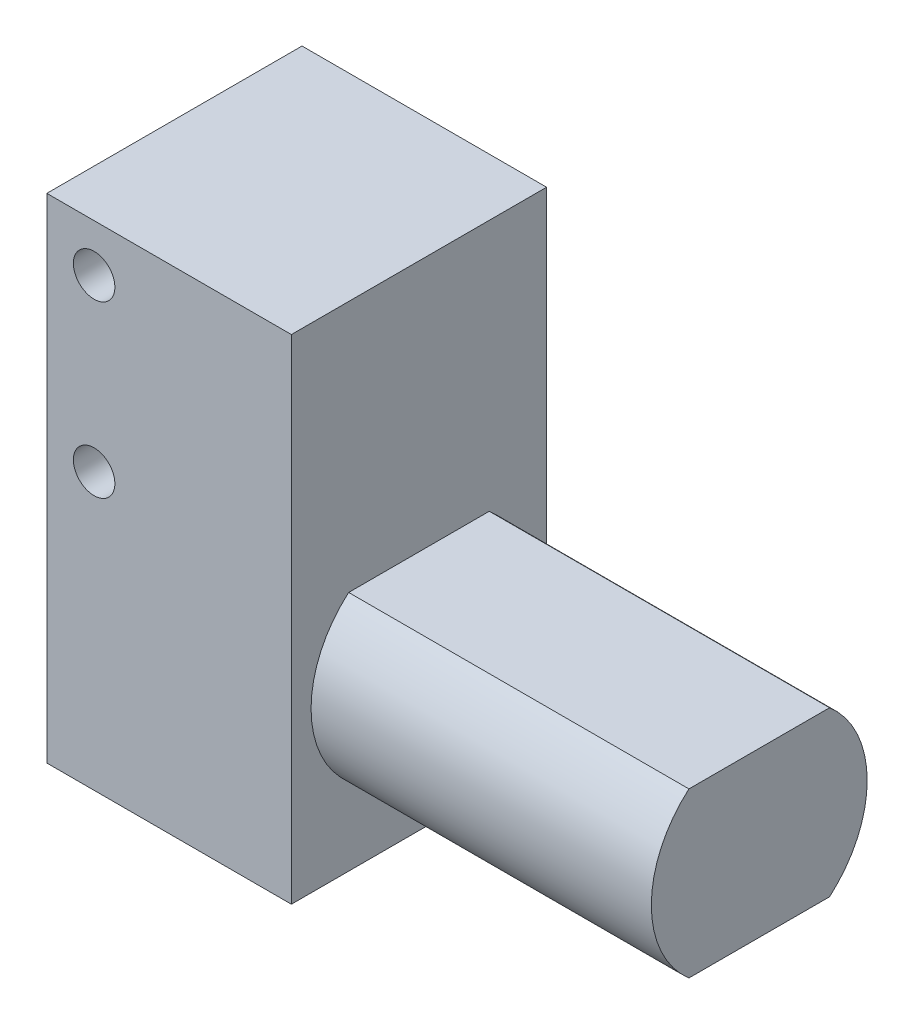
ISO-10303-21;
HEADER;
FILE_DESCRIPTION(('STEP AP214'),'2;1');
FILE_NAME('part.step','',(''),(''),'','','');
FILE_SCHEMA(('AUTOMOTIVE_DESIGN { 1 0 10303 214 1 1 1 1 }'));
ENDSEC;
DATA;
#1=APPLICATION_CONTEXT('core data for automotive mechanical design processes');
#2=APPLICATION_PROTOCOL_DEFINITION('international standard','automotive_design',2000,#1);
#3=PRODUCT_CONTEXT('',#1,'mechanical');
#4=PRODUCT('Part','Part','',(#3));
#5=PRODUCT_RELATED_PRODUCT_CATEGORY('part','',(#4));
#6=PRODUCT_DEFINITION_FORMATION('','',#4);
#7=PRODUCT_DEFINITION_CONTEXT('part definition',#1,'design');
#8=PRODUCT_DEFINITION('design','',#6,#7);
#9=PRODUCT_DEFINITION_SHAPE('','',#8);
#10=(LENGTH_UNIT() NAMED_UNIT(*) SI_UNIT(.MILLI.,.METRE.));
#11=(NAMED_UNIT(*) PLANE_ANGLE_UNIT() SI_UNIT($,.RADIAN.));
#12=(NAMED_UNIT(*) SI_UNIT($,.STERADIAN.) SOLID_ANGLE_UNIT());
#13=UNCERTAINTY_MEASURE_WITH_UNIT(LENGTH_MEASURE(1.E-05),#10,'distance_accuracy_value','');
#14=(GEOMETRIC_REPRESENTATION_CONTEXT(3) GLOBAL_UNCERTAINTY_ASSIGNED_CONTEXT((#13)) GLOBAL_UNIT_ASSIGNED_CONTEXT((#10,
#11,#12)) REPRESENTATION_CONTEXT('',''));
#15=CARTESIAN_POINT('',(0.,0.,0.));
#16=DIRECTION('',(0.,0.,1.));
#17=DIRECTION('',(1.,0.,0.));
#18=AXIS2_PLACEMENT_3D('',#15,#16,#17);
#19=CARTESIAN_POINT('',(55.,15.,0.));
#20=DIRECTION('',(-1.,0.,0.));
#21=DIRECTION('',(0.,0.,1.));
#22=AXIS2_PLACEMENT_3D('',#19,#20,#21);
#23=CYLINDRICAL_SURFACE('',#22,10.15);
#24=CARTESIAN_POINT('',(23.,15.,0.));
#25=DIRECTION('',(-1.,0.,0.));
#26=DIRECTION('',(0.,0.,1.));
#27=AXIS2_PLACEMENT_3D('',#24,#25,#26);
#28=CIRCLE('',#27,10.15);
#29=CARTESIAN_POINT('',(23.,7.3,-6.61305526969192));
#30=VERTEX_POINT('',#29);
#31=CARTESIAN_POINT('',(23.,22.7,-6.61305526969192));
#32=VERTEX_POINT('',#31);
#33=EDGE_CURVE('E303',#30,#32,#28,.F.);
#34=ORIENTED_EDGE('',*,*,#33,.T.);
#35=DIRECTION('',(-1.,0.,0.));
#36=VECTOR('',#35,1.);
#37=CARTESIAN_POINT('',(55.,22.7,-6.61305526969192));
#38=LINE('',#37,#36);
#39=CARTESIAN_POINT('',(55.,22.7,-6.61305526969192));
#40=VERTEX_POINT('',#39);
#41=EDGE_CURVE('E192',#32,#40,#38,.F.);
#42=ORIENTED_EDGE('',*,*,#41,.T.);
#43=CARTESIAN_POINT('',(55.,15.,0.));
#44=DIRECTION('',(1.,0.,0.));
#45=DIRECTION('',(0.,0.,-1.));
#46=AXIS2_PLACEMENT_3D('',#43,#44,#45);
#47=CIRCLE('',#46,10.15);
#48=CARTESIAN_POINT('',(55.,7.3,-6.61305526969192));
#49=VERTEX_POINT('',#48);
#50=EDGE_CURVE('E198',#49,#40,#47,.T.);
#51=ORIENTED_EDGE('',*,*,#50,.F.);
#52=DIRECTION('',(-1.,0.,0.));
#53=VECTOR('',#52,1.);
#54=CARTESIAN_POINT('',(55.,7.3,-6.61305526969192));
#55=LINE('',#54,#53);
#56=EDGE_CURVE('E56',#49,#30,#55,.T.);
#57=ORIENTED_EDGE('',*,*,#56,.T.);
#58=EDGE_LOOP('',(#34,#42,#51,#57));
#59=FACE_BOUND('',#58,.T.);
#60=ADVANCED_FACE('F33',(#59),#23,.T.);
#61=CARTESIAN_POINT('',(-9.,34.2,0.));
#62=DIRECTION('',(1.,0.,0.));
#63=DIRECTION('',(0.,0.,-1.));
#64=AXIS2_PLACEMENT_3D('',#61,#62,#63);
#65=CYLINDRICAL_SURFACE('',#64,2.7);
#66=CARTESIAN_POINT('',(0.,34.2,0.));
#67=DIRECTION('',(1.,0.,0.));
#68=DIRECTION('',(0.,0.,-1.));
#69=AXIS2_PLACEMENT_3D('',#66,#67,#68);
#70=CIRCLE('',#69,2.7);
#71=CARTESIAN_POINT('',(0.,34.2,-2.7));
#72=VERTEX_POINT('',#71);
#73=EDGE_CURVE('E288',#72,#72,#70,.F.);
#74=ORIENTED_EDGE('',*,*,#73,.T.);
#75=EDGE_LOOP('',(#74));
#76=FACE_BOUND('',#75,.T.);
#77=DIRECTION('',(1.,0.,0.));
#78=VECTOR('',#77,1.);
#79=CARTESIAN_POINT('',(-9.,36.2560885194952,-1.75));
#80=LINE('',#79,#78);
#81=CARTESIAN_POINT('',(-9.,36.2560885194952,-1.75));
#82=VERTEX_POINT('',#81);
#83=CARTESIAN_POINT('',(-2.,36.2560885194952,-1.75));
#84=VERTEX_POINT('',#83);
#85=EDGE_CURVE('E227',#82,#84,#80,.T.);
#86=ORIENTED_EDGE('',*,*,#85,.F.);
#87=CARTESIAN_POINT('',(-9.,34.2,0.));
#88=DIRECTION('',(-1.,0.,0.));
#89=DIRECTION('',(0.,0.,1.));
#90=AXIS2_PLACEMENT_3D('',#87,#88,#89);
#91=CIRCLE('',#90,2.7);
#92=CARTESIAN_POINT('',(-9.,36.2560885194952,1.75));
#93=VERTEX_POINT('',#92);
#94=EDGE_CURVE('E233',#93,#82,#91,.T.);
#95=ORIENTED_EDGE('',*,*,#94,.F.);
#96=DIRECTION('',(1.,0.,0.));
#97=VECTOR('',#96,1.);
#98=CARTESIAN_POINT('',(-9.,36.2560885194952,1.75));
#99=LINE('',#98,#97);
#100=CARTESIAN_POINT('',(-2.,36.2560885194952,1.75));
#101=VERTEX_POINT('',#100);
#102=EDGE_CURVE('E218',#101,#93,#99,.F.);
#103=ORIENTED_EDGE('',*,*,#102,.F.);
#104=CARTESIAN_POINT('',(-2.,34.2,0.));
#105=DIRECTION('',(-1.,0.,0.));
#106=DIRECTION('',(0.,0.,1.));
#107=AXIS2_PLACEMENT_3D('',#104,#105,#106);
#108=CIRCLE('',#107,2.7);
#109=CARTESIAN_POINT('',(-2.,32.1439114805048,1.75));
#110=VERTEX_POINT('',#109);
#111=EDGE_CURVE('E297',#110,#101,#108,.T.);
#112=ORIENTED_EDGE('',*,*,#111,.F.);
#113=DIRECTION('',(1.,0.,0.));
#114=VECTOR('',#113,1.);
#115=CARTESIAN_POINT('',(-9.,32.1439114805048,1.75));
#116=LINE('',#115,#114);
#117=CARTESIAN_POINT('',(-9.,32.1439114805048,1.75));
#118=VERTEX_POINT('',#117);
#119=EDGE_CURVE('E222',#118,#110,#116,.T.);
#120=ORIENTED_EDGE('',*,*,#119,.F.);
#121=CARTESIAN_POINT('',(-9.,32.1439114805048,-1.75));
#122=VERTEX_POINT('',#121);
#123=EDGE_CURVE('E230',#122,#118,#91,.T.);
#124=ORIENTED_EDGE('',*,*,#123,.F.);
#125=DIRECTION('',(1.,0.,0.));
#126=VECTOR('',#125,1.);
#127=CARTESIAN_POINT('',(-9.,32.1439114805048,-1.75));
#128=LINE('',#127,#126);
#129=CARTESIAN_POINT('',(-2.,32.1439114805048,-1.75));
#130=VERTEX_POINT('',#129);
#131=EDGE_CURVE('E225',#130,#122,#128,.F.);
#132=ORIENTED_EDGE('',*,*,#131,.F.);
#133=CARTESIAN_POINT('',(-2.,34.2,0.));
#134=DIRECTION('',(-1.,0.,0.));
#135=DIRECTION('',(0.,0.,1.));
#136=AXIS2_PLACEMENT_3D('',#133,#134,#135);
#137=CIRCLE('',#136,2.7);
#138=EDGE_CURVE('E299',#84,#130,#137,.T.);
#139=ORIENTED_EDGE('',*,*,#138,.F.);
#140=EDGE_LOOP('',(#86,#95,#103,#112,#120,#124,#132,#139));
#141=FACE_BOUND('',#140,.T.);
#142=ADVANCED_FACE('F333',(#76,#141),#65,.T.);
#143=CARTESIAN_POINT('',(-9.,34.2,0.));
#144=DIRECTION('',(-1.,0.,0.));
#145=DIRECTION('',(0.,0.,1.));
#146=AXIS2_PLACEMENT_3D('',#143,#144,#145);
#147=PLANE('',#146);
#148=ORIENTED_EDGE('',*,*,#94,.T.);
#149=DIRECTION('',(0.,-1.,0.));
#150=VECTOR('',#149,1.);
#151=CARTESIAN_POINT('',(-9.,34.2,-1.75));
#152=LINE('',#151,#150);
#153=EDGE_CURVE('E294',#82,#122,#152,.T.);
#154=ORIENTED_EDGE('',*,*,#153,.T.);
#155=ORIENTED_EDGE('',*,*,#123,.T.);
#156=DIRECTION('',(0.,1.,0.));
#157=VECTOR('',#156,1.);
#158=CARTESIAN_POINT('',(-9.,34.2,1.75));
#159=LINE('',#158,#157);
#160=EDGE_CURVE('E291',#118,#93,#159,.T.);
#161=ORIENTED_EDGE('',*,*,#160,.T.);
#162=EDGE_LOOP('',(#148,#154,#155,#161));
#163=FACE_BOUND('',#162,.T.);
#164=ADVANCED_FACE('F337',(#163),#147,.T.);
#165=CARTESIAN_POINT('',(0.,0.,12.));
#166=DIRECTION('',(1.,0.,0.));
#167=DIRECTION('',(0.,0.,-1.));
#168=AXIS2_PLACEMENT_3D('',#165,#166,#167);
#169=PLANE('',#168);
#170=CARTESIAN_POINT('',(0.,10.45,-8.));
#171=DIRECTION('',(-1.,0.,0.));
#172=DIRECTION('',(0.,0.,1.));
#173=AXIS2_PLACEMENT_3D('',#170,#171,#172);
#174=CIRCLE('',#173,1.95);
#175=CARTESIAN_POINT('',(0.,10.45,-6.05));
#176=VERTEX_POINT('',#175);
#177=EDGE_CURVE('E206',#176,#176,#174,.T.);
#178=ORIENTED_EDGE('',*,*,#177,.F.);
#179=EDGE_LOOP('',(#178));
#180=FACE_BOUND('',#179,.T.);
#181=CARTESIAN_POINT('',(0.,10.45,8.));
#182=DIRECTION('',(-1.,0.,0.));
#183=DIRECTION('',(0.,0.,-1.));
#184=AXIS2_PLACEMENT_3D('',#181,#182,#183);
#185=CIRCLE('',#184,1.95);
#186=CARTESIAN_POINT('',(0.,10.45,6.05));
#187=VERTEX_POINT('',#186);
#188=EDGE_CURVE('E212',#187,#187,#185,.T.);
#189=ORIENTED_EDGE('',*,*,#188,.F.);
#190=EDGE_LOOP('',(#189));
#191=FACE_BOUND('',#190,.T.);
#192=ORIENTED_EDGE('',*,*,#73,.F.);
#193=EDGE_LOOP('',(#192));
#194=FACE_BOUND('',#193,.T.);
#195=DIRECTION('',(0.,-1.,0.));
#196=VECTOR('',#195,1.);
#197=CARTESIAN_POINT('',(0.,0.,-12.));
#198=LINE('',#197,#196);
#199=CARTESIAN_POINT('',(0.,46.4,-12.));
#200=VERTEX_POINT('',#199);
#201=CARTESIAN_POINT('',(0.,0.,-12.));
#202=VERTEX_POINT('',#201);
#203=EDGE_CURVE('E250',#200,#202,#198,.T.);
#204=ORIENTED_EDGE('',*,*,#203,.T.);
#205=DIRECTION('',(0.,0.,-1.));
#206=VECTOR('',#205,1.);
#207=CARTESIAN_POINT('',(0.,0.,12.));
#208=LINE('',#207,#206);
#209=CARTESIAN_POINT('',(0.,0.,12.));
#210=VERTEX_POINT('',#209);
#211=EDGE_CURVE('E285',#210,#202,#208,.T.);
#212=ORIENTED_EDGE('',*,*,#211,.F.);
#213=DIRECTION('',(0.,-1.,0.));
#214=VECTOR('',#213,1.);
#215=CARTESIAN_POINT('',(0.,0.,12.));
#216=LINE('',#215,#214);
#217=CARTESIAN_POINT('',(0.,46.4,12.));
#218=VERTEX_POINT('',#217);
#219=EDGE_CURVE('E259',#218,#210,#216,.T.);
#220=ORIENTED_EDGE('',*,*,#219,.F.);
#221=DIRECTION('',(0.,0.,-1.));
#222=VECTOR('',#221,1.);
#223=CARTESIAN_POINT('',(0.,46.4,12.));
#224=LINE('',#223,#222);
#225=EDGE_CURVE('E269',#218,#200,#224,.T.);
#226=ORIENTED_EDGE('',*,*,#225,.T.);
#227=EDGE_LOOP('',(#204,#212,#220,#226));
#228=FACE_BOUND('',#227,.T.);
#229=ADVANCED_FACE('F35',(#180,#191,#194,#228),#169,.F.);
#230=CARTESIAN_POINT('',(0.,0.,12.));
#231=DIRECTION('',(0.,1.,0.));
#232=DIRECTION('',(0.,0.,1.));
#233=AXIS2_PLACEMENT_3D('',#230,#231,#232);
#234=PLANE('',#233);
#235=DIRECTION('',(1.,0.,0.));
#236=VECTOR('',#235,1.);
#237=CARTESIAN_POINT('',(13.,0.,-4.5));
#238=LINE('',#237,#236);
#239=CARTESIAN_POINT('',(13.,0.,-4.5));
#240=VERTEX_POINT('',#239);
#241=CARTESIAN_POINT('',(16.,0.,-4.5));
#242=VERTEX_POINT('',#241);
#243=EDGE_CURVE('E174',#240,#242,#238,.T.);
#244=ORIENTED_EDGE('',*,*,#243,.F.);
#245=DIRECTION('',(0.,0.,-1.));
#246=VECTOR('',#245,1.);
#247=CARTESIAN_POINT('',(13.,0.,4.5));
#248=LINE('',#247,#246);
#249=CARTESIAN_POINT('',(13.,0.,4.5));
#250=VERTEX_POINT('',#249);
#251=EDGE_CURVE('E48',#250,#240,#248,.T.);
#252=ORIENTED_EDGE('',*,*,#251,.F.);
#253=DIRECTION('',(-1.,0.,0.));
#254=VECTOR('',#253,1.);
#255=CARTESIAN_POINT('',(13.,0.,4.5));
#256=LINE('',#255,#254);
#257=CARTESIAN_POINT('',(16.,0.,4.5));
#258=VERTEX_POINT('',#257);
#259=EDGE_CURVE('E165',#258,#250,#256,.T.);
#260=ORIENTED_EDGE('',*,*,#259,.F.);
#261=DIRECTION('',(0.,0.,1.));
#262=VECTOR('',#261,1.);
#263=CARTESIAN_POINT('',(16.,0.,4.5));
#264=LINE('',#263,#262);
#265=EDGE_CURVE('E168',#242,#258,#264,.T.);
#266=ORIENTED_EDGE('',*,*,#265,.F.);
#267=EDGE_LOOP('',(#244,#252,#260,#266));
#268=FACE_BOUND('',#267,.T.);
#269=DIRECTION('',(1.,0.,0.));
#270=VECTOR('',#269,1.);
#271=CARTESIAN_POINT('',(0.,0.,-12.));
#272=LINE('',#271,#270);
#273=CARTESIAN_POINT('',(23.,0.,-12.));
#274=VERTEX_POINT('',#273);
#275=EDGE_CURVE('E272',#202,#274,#272,.T.);
#276=ORIENTED_EDGE('',*,*,#275,.T.);
#277=DIRECTION('',(0.,0.,-1.));
#278=VECTOR('',#277,1.);
#279=CARTESIAN_POINT('',(23.,0.,12.));
#280=LINE('',#279,#278);
#281=CARTESIAN_POINT('',(23.,0.,12.));
#282=VERTEX_POINT('',#281);
#283=EDGE_CURVE('E282',#282,#274,#280,.T.);
#284=ORIENTED_EDGE('',*,*,#283,.F.);
#285=DIRECTION('',(1.,0.,0.));
#286=VECTOR('',#285,1.);
#287=CARTESIAN_POINT('',(0.,0.,12.));
#288=LINE('',#287,#286);
#289=EDGE_CURVE('E262',#210,#282,#288,.T.);
#290=ORIENTED_EDGE('',*,*,#289,.F.);
#291=ORIENTED_EDGE('',*,*,#211,.T.);
#292=EDGE_LOOP('',(#276,#284,#290,#291));
#293=FACE_BOUND('',#292,.T.);
#294=ADVANCED_FACE('F420',(#268,#293),#234,.F.);
#295=CARTESIAN_POINT('',(23.,0.,12.));
#296=DIRECTION('',(-1.,0.,0.));
#297=DIRECTION('',(0.,0.,1.));
#298=AXIS2_PLACEMENT_3D('',#295,#296,#297);
#299=PLANE('',#298);
#300=DIRECTION('',(0.,0.,1.));
#301=VECTOR('',#300,1.);
#302=CARTESIAN_POINT('',(23.,22.7,-12.));
#303=LINE('',#302,#301);
#304=CARTESIAN_POINT('',(23.,22.7,6.61305526969192));
#305=VERTEX_POINT('',#304);
#306=EDGE_CURVE('E184',#32,#305,#303,.T.);
#307=ORIENTED_EDGE('',*,*,#306,.F.);
#308=ORIENTED_EDGE('',*,*,#33,.F.);
#309=DIRECTION('',(0.,0.,1.));
#310=VECTOR('',#309,1.);
#311=CARTESIAN_POINT('',(23.,7.3,-12.));
#312=LINE('',#311,#310);
#313=CARTESIAN_POINT('',(23.,7.3,6.61305526969191));
#314=VERTEX_POINT('',#313);
#315=EDGE_CURVE('E180',#30,#314,#312,.T.);
#316=ORIENTED_EDGE('',*,*,#315,.T.);
#317=EDGE_CURVE('E301',#305,#314,#28,.F.);
#318=ORIENTED_EDGE('',*,*,#317,.F.);
#319=EDGE_LOOP('',(#307,#308,#316,#318));
#320=FACE_BOUND('',#319,.T.);
#321=DIRECTION('',(0.,0.,-1.));
#322=VECTOR('',#321,1.);
#323=CARTESIAN_POINT('',(23.,46.4,12.));
#324=LINE('',#323,#322);
#325=CARTESIAN_POINT('',(23.,46.4,12.));
#326=VERTEX_POINT('',#325);
#327=CARTESIAN_POINT('',(23.,46.4,-12.));
#328=VERTEX_POINT('',#327);
#329=EDGE_CURVE('E279',#326,#328,#324,.T.);
#330=ORIENTED_EDGE('',*,*,#329,.F.);
#331=DIRECTION('',(0.,1.,0.));
#332=VECTOR('',#331,1.);
#333=CARTESIAN_POINT('',(23.,0.,12.));
#334=LINE('',#333,#332);
#335=EDGE_CURVE('E265',#282,#326,#334,.T.);
#336=ORIENTED_EDGE('',*,*,#335,.F.);
#337=ORIENTED_EDGE('',*,*,#283,.T.);
#338=DIRECTION('',(0.,1.,0.));
#339=VECTOR('',#338,1.);
#340=CARTESIAN_POINT('',(23.,0.,-12.));
#341=LINE('',#340,#339);
#342=EDGE_CURVE('E274',#274,#328,#341,.T.);
#343=ORIENTED_EDGE('',*,*,#342,.T.);
#344=EDGE_LOOP('',(#330,#336,#337,#343));
#345=FACE_BOUND('',#344,.T.);
#346=ADVANCED_FACE('F310',(#320,#345),#299,.F.);
#347=CARTESIAN_POINT('',(0.,46.4,12.));
#348=DIRECTION('',(0.,-1.,0.));
#349=DIRECTION('',(0.,0.,-1.));
#350=AXIS2_PLACEMENT_3D('',#347,#348,#349);
#351=PLANE('',#350);
#352=DIRECTION('',(-1.,0.,0.));
#353=VECTOR('',#352,1.);
#354=CARTESIAN_POINT('',(0.,46.4,-12.));
#355=LINE('',#354,#353);
#356=EDGE_CURVE('E263',#328,#200,#355,.T.);
#357=ORIENTED_EDGE('',*,*,#356,.T.);
#358=ORIENTED_EDGE('',*,*,#225,.F.);
#359=DIRECTION('',(-1.,0.,0.));
#360=VECTOR('',#359,1.);
#361=CARTESIAN_POINT('',(0.,46.4,12.));
#362=LINE('',#361,#360);
#363=EDGE_CURVE('E267',#326,#218,#362,.T.);
#364=ORIENTED_EDGE('',*,*,#363,.F.);
#365=ORIENTED_EDGE('',*,*,#329,.T.);
#366=EDGE_LOOP('',(#357,#358,#364,#365));
#367=FACE_BOUND('',#366,.T.);
#368=ADVANCED_FACE('F411',(#367),#351,.F.);
#369=CARTESIAN_POINT('',(0.,0.,12.));
#370=DIRECTION('',(0.,0.,-1.));
#371=DIRECTION('',(-1.,0.,0.));
#372=AXIS2_PLACEMENT_3D('',#369,#370,#371);
#373=PLANE('',#372);
#374=CARTESIAN_POINT('',(4.45,41.95,12.));
#375=DIRECTION('',(0.,0.,1.));
#376=DIRECTION('',(1.,0.,0.));
#377=AXIS2_PLACEMENT_3D('',#374,#375,#376);
#378=CIRCLE('',#377,1.95);
#379=CARTESIAN_POINT('',(6.4,41.95,12.));
#380=VERTEX_POINT('',#379);
#381=EDGE_CURVE('E251',#380,#380,#378,.T.);
#382=ORIENTED_EDGE('',*,*,#381,.F.);
#383=EDGE_LOOP('',(#382));
#384=FACE_BOUND('',#383,.T.);
#385=CARTESIAN_POINT('',(4.45,25.95,12.));
#386=DIRECTION('',(0.,0.,1.));
#387=DIRECTION('',(1.,0.,0.));
#388=AXIS2_PLACEMENT_3D('',#385,#386,#387);
#389=CIRCLE('',#388,1.95);
#390=CARTESIAN_POINT('',(6.4,25.95,12.));
#391=VERTEX_POINT('',#390);
#392=EDGE_CURVE('E237',#391,#391,#389,.T.);
#393=ORIENTED_EDGE('',*,*,#392,.F.);
#394=EDGE_LOOP('',(#393));
#395=FACE_BOUND('',#394,.T.);
#396=ORIENTED_EDGE('',*,*,#219,.T.);
#397=ORIENTED_EDGE('',*,*,#289,.T.);
#398=ORIENTED_EDGE('',*,*,#335,.T.);
#399=ORIENTED_EDGE('',*,*,#363,.T.);
#400=EDGE_LOOP('',(#396,#397,#398,#399));
#401=FACE_BOUND('',#400,.T.);
#402=ADVANCED_FACE('F408',(#384,#395,#401),#373,.F.);
#403=CARTESIAN_POINT('',(0.,0.,-12.));
#404=DIRECTION('',(0.,0.,-1.));
#405=DIRECTION('',(-1.,0.,0.));
#406=AXIS2_PLACEMENT_3D('',#403,#404,#405);
#407=PLANE('',#406);
#408=CARTESIAN_POINT('',(4.45,41.95,-12.));
#409=DIRECTION('',(0.,0.,1.));
#410=DIRECTION('',(1.,0.,0.));
#411=AXIS2_PLACEMENT_3D('',#408,#409,#410);
#412=CIRCLE('',#411,1.95);
#413=CARTESIAN_POINT('',(6.4,41.95,-12.));
#414=VERTEX_POINT('',#413);
#415=EDGE_CURVE('E238',#414,#414,#412,.T.);
#416=ORIENTED_EDGE('',*,*,#415,.T.);
#417=EDGE_LOOP('',(#416));
#418=FACE_BOUND('',#417,.T.);
#419=CARTESIAN_POINT('',(4.45,25.95,-12.));
#420=DIRECTION('',(0.,0.,1.));
#421=DIRECTION('',(1.,0.,0.));
#422=AXIS2_PLACEMENT_3D('',#419,#420,#421);
#423=CIRCLE('',#422,1.95);
#424=CARTESIAN_POINT('',(6.4,25.95,-12.));
#425=VERTEX_POINT('',#424);
#426=EDGE_CURVE('E244',#425,#425,#423,.T.);
#427=ORIENTED_EDGE('',*,*,#426,.T.);
#428=EDGE_LOOP('',(#427));
#429=FACE_BOUND('',#428,.T.);
#430=ORIENTED_EDGE('',*,*,#203,.F.);
#431=ORIENTED_EDGE('',*,*,#356,.F.);
#432=ORIENTED_EDGE('',*,*,#342,.F.);
#433=ORIENTED_EDGE('',*,*,#275,.F.);
#434=EDGE_LOOP('',(#430,#431,#432,#433));
#435=FACE_BOUND('',#434,.T.);
#436=ADVANCED_FACE('F406',(#418,#429,#435),#407,.T.);
#437=CARTESIAN_POINT('',(4.45,25.95,6.5));
#438=DIRECTION('',(0.,0.,1.));
#439=DIRECTION('',(1.,0.,0.));
#440=AXIS2_PLACEMENT_3D('',#437,#438,#439);
#441=CYLINDRICAL_SURFACE('',#440,1.95);
#442=CARTESIAN_POINT('',(4.45,25.95,6.5));
#443=DIRECTION('',(0.,0.,1.));
#444=DIRECTION('',(1.,0.,0.));
#445=AXIS2_PLACEMENT_3D('',#442,#443,#444);
#446=CIRCLE('',#445,1.95);
#447=CARTESIAN_POINT('',(6.4,25.95,6.5));
#448=VERTEX_POINT('',#447);
#449=EDGE_CURVE('E254',#448,#448,#446,.T.);
#450=ORIENTED_EDGE('',*,*,#449,.F.);
#451=EDGE_LOOP('',(#450));
#452=FACE_BOUND('',#451,.T.);
#453=ORIENTED_EDGE('',*,*,#392,.T.);
#454=EDGE_LOOP('',(#453));
#455=FACE_BOUND('',#454,.T.);
#456=ADVANCED_FACE('F402',(#452,#455),#441,.F.);
#457=CARTESIAN_POINT('',(4.45,25.95,6.5));
#458=DIRECTION('',(0.,0.,1.));
#459=DIRECTION('',(1.,0.,0.));
#460=AXIS2_PLACEMENT_3D('',#457,#458,#459);
#461=PLANE('',#460);
#462=ORIENTED_EDGE('',*,*,#449,.T.);
#463=EDGE_LOOP('',(#462));
#464=FACE_BOUND('',#463,.T.);
#465=ADVANCED_FACE('F398',(#464),#461,.T.);
#466=CARTESIAN_POINT('',(4.45,41.95,6.5));
#467=DIRECTION('',(0.,0.,1.));
#468=DIRECTION('',(1.,0.,0.));
#469=AXIS2_PLACEMENT_3D('',#466,#467,#468);
#470=CYLINDRICAL_SURFACE('',#469,1.95);
#471=CARTESIAN_POINT('',(4.45,41.95,6.5));
#472=DIRECTION('',(0.,0.,1.));
#473=DIRECTION('',(1.,0.,0.));
#474=AXIS2_PLACEMENT_3D('',#471,#472,#473);
#475=CIRCLE('',#474,1.95);
#476=CARTESIAN_POINT('',(6.4,41.95,6.5));
#477=VERTEX_POINT('',#476);
#478=EDGE_CURVE('E247',#477,#477,#475,.T.);
#479=ORIENTED_EDGE('',*,*,#478,.F.);
#480=EDGE_LOOP('',(#479));
#481=FACE_BOUND('',#480,.T.);
#482=ORIENTED_EDGE('',*,*,#381,.T.);
#483=EDGE_LOOP('',(#482));
#484=FACE_BOUND('',#483,.T.);
#485=ADVANCED_FACE('F394',(#481,#484),#470,.F.);
#486=CARTESIAN_POINT('',(4.45,41.95,6.5));
#487=DIRECTION('',(0.,0.,1.));
#488=DIRECTION('',(1.,0.,0.));
#489=AXIS2_PLACEMENT_3D('',#486,#487,#488);
#490=PLANE('',#489);
#491=ORIENTED_EDGE('',*,*,#478,.T.);
#492=EDGE_LOOP('',(#491));
#493=FACE_BOUND('',#492,.T.);
#494=ADVANCED_FACE('F390',(#493),#490,.T.);
#495=CARTESIAN_POINT('',(4.45,25.95,-6.5));
#496=DIRECTION('',(0.,0.,-1.));
#497=DIRECTION('',(-1.,0.,0.));
#498=AXIS2_PLACEMENT_3D('',#495,#496,#497);
#499=CYLINDRICAL_SURFACE('',#498,1.95);
#500=CARTESIAN_POINT('',(4.45,25.95,-6.5));
#501=DIRECTION('',(0.,0.,1.));
#502=DIRECTION('',(1.,0.,0.));
#503=AXIS2_PLACEMENT_3D('',#500,#501,#502);
#504=CIRCLE('',#503,1.95);
#505=CARTESIAN_POINT('',(6.4,25.95,-6.5));
#506=VERTEX_POINT('',#505);
#507=EDGE_CURVE('E241',#506,#506,#504,.T.);
#508=ORIENTED_EDGE('',*,*,#507,.T.);
#509=EDGE_LOOP('',(#508));
#510=FACE_BOUND('',#509,.T.);
#511=ORIENTED_EDGE('',*,*,#426,.F.);
#512=EDGE_LOOP('',(#511));
#513=FACE_BOUND('',#512,.T.);
#514=ADVANCED_FACE('F386',(#510,#513),#499,.F.);
#515=CARTESIAN_POINT('',(4.45,25.95,-6.5));
#516=DIRECTION('',(0.,0.,-1.));
#517=DIRECTION('',(1.,0.,0.));
#518=AXIS2_PLACEMENT_3D('',#515,#516,#517);
#519=PLANE('',#518);
#520=ORIENTED_EDGE('',*,*,#507,.F.);
#521=EDGE_LOOP('',(#520));
#522=FACE_BOUND('',#521,.T.);
#523=ADVANCED_FACE('F382',(#522),#519,.T.);
#524=CARTESIAN_POINT('',(4.45,41.95,-6.5));
#525=DIRECTION('',(0.,0.,-1.));
#526=DIRECTION('',(-1.,0.,0.));
#527=AXIS2_PLACEMENT_3D('',#524,#525,#526);
#528=CYLINDRICAL_SURFACE('',#527,1.95);
#529=CARTESIAN_POINT('',(4.45,41.95,-6.5));
#530=DIRECTION('',(0.,0.,1.));
#531=DIRECTION('',(1.,0.,0.));
#532=AXIS2_PLACEMENT_3D('',#529,#530,#531);
#533=CIRCLE('',#532,1.95);
#534=CARTESIAN_POINT('',(6.4,41.95,-6.5));
#535=VERTEX_POINT('',#534);
#536=EDGE_CURVE('E234',#535,#535,#533,.T.);
#537=ORIENTED_EDGE('',*,*,#536,.T.);
#538=EDGE_LOOP('',(#537));
#539=FACE_BOUND('',#538,.T.);
#540=ORIENTED_EDGE('',*,*,#415,.F.);
#541=EDGE_LOOP('',(#540));
#542=FACE_BOUND('',#541,.T.);
#543=ADVANCED_FACE('F378',(#539,#542),#528,.F.);
#544=CARTESIAN_POINT('',(4.45,41.95,-6.5));
#545=DIRECTION('',(0.,0.,-1.));
#546=DIRECTION('',(1.,0.,0.));
#547=AXIS2_PLACEMENT_3D('',#544,#545,#546);
#548=PLANE('',#547);
#549=ORIENTED_EDGE('',*,*,#536,.F.);
#550=EDGE_LOOP('',(#549));
#551=FACE_BOUND('',#550,.T.);
#552=ADVANCED_FACE('F371',(#551),#548,.T.);
#553=CARTESIAN_POINT('',(-2.,46.4,1.75));
#554=DIRECTION('',(-1.,0.,0.));
#555=DIRECTION('',(0.,0.,1.));
#556=AXIS2_PLACEMENT_3D('',#553,#554,#555);
#557=PLANE('',#556);
#558=ORIENTED_EDGE('',*,*,#111,.T.);
#559=DIRECTION('',(0.,-1.,0.));
#560=VECTOR('',#559,1.);
#561=CARTESIAN_POINT('',(-2.,46.4,1.75));
#562=LINE('',#561,#560);
#563=EDGE_CURVE('E205',#101,#110,#562,.T.);
#564=ORIENTED_EDGE('',*,*,#563,.T.);
#565=EDGE_LOOP('',(#558,#564));
#566=FACE_BOUND('',#565,.T.);
#567=ADVANCED_FACE('F367',(#566),#557,.T.);
#568=CARTESIAN_POINT('',(-9.,46.4,1.75));
#569=DIRECTION('',(0.,0.,1.));
#570=DIRECTION('',(1.,0.,0.));
#571=AXIS2_PLACEMENT_3D('',#568,#569,#570);
#572=PLANE('',#571);
#573=ORIENTED_EDGE('',*,*,#119,.T.);
#574=ORIENTED_EDGE('',*,*,#563,.F.);
#575=ORIENTED_EDGE('',*,*,#102,.T.);
#576=ORIENTED_EDGE('',*,*,#160,.F.);
#577=EDGE_LOOP('',(#573,#574,#575,#576));
#578=FACE_BOUND('',#577,.T.);
#579=ADVANCED_FACE('F360',(#578),#572,.T.);
#580=CARTESIAN_POINT('',(-2.,46.4,-1.75));
#581=DIRECTION('',(-1.,0.,0.));
#582=DIRECTION('',(0.,0.,1.));
#583=AXIS2_PLACEMENT_3D('',#580,#581,#582);
#584=PLANE('',#583);
#585=DIRECTION('',(0.,-1.,0.));
#586=VECTOR('',#585,1.);
#587=CARTESIAN_POINT('',(-2.,46.4,-1.75));
#588=LINE('',#587,#586);
#589=EDGE_CURVE('E215',#84,#130,#588,.T.);
#590=ORIENTED_EDGE('',*,*,#589,.F.);
#591=ORIENTED_EDGE('',*,*,#138,.T.);
#592=EDGE_LOOP('',(#590,#591));
#593=FACE_BOUND('',#592,.T.);
#594=ADVANCED_FACE('F357',(#593),#584,.T.);
#595=CARTESIAN_POINT('',(-9.,46.4,-1.75));
#596=DIRECTION('',(0.,0.,-1.));
#597=DIRECTION('',(-1.,0.,0.));
#598=AXIS2_PLACEMENT_3D('',#595,#596,#597);
#599=PLANE('',#598);
#600=ORIENTED_EDGE('',*,*,#85,.T.);
#601=ORIENTED_EDGE('',*,*,#589,.T.);
#602=ORIENTED_EDGE('',*,*,#131,.T.);
#603=ORIENTED_EDGE('',*,*,#153,.F.);
#604=EDGE_LOOP('',(#600,#601,#602,#603));
#605=FACE_BOUND('',#604,.T.);
#606=ADVANCED_FACE('F355',(#605),#599,.T.);
#607=CARTESIAN_POINT('',(5.5,10.45,8.));
#608=DIRECTION('',(-1.,0.,0.));
#609=DIRECTION('',(0.,0.,1.));
#610=AXIS2_PLACEMENT_3D('',#607,#608,#609);
#611=CYLINDRICAL_SURFACE('',#610,1.95);
#612=CARTESIAN_POINT('',(5.5,10.45,8.));
#613=DIRECTION('',(-1.,0.,0.));
#614=DIRECTION('',(0.,0.,-1.));
#615=AXIS2_PLACEMENT_3D('',#612,#613,#614);
#616=CIRCLE('',#615,1.95);
#617=CARTESIAN_POINT('',(5.5,10.45,6.05));
#618=VERTEX_POINT('',#617);
#619=EDGE_CURVE('E209',#618,#618,#616,.T.);
#620=ORIENTED_EDGE('',*,*,#619,.F.);
#621=EDGE_LOOP('',(#620));
#622=FACE_BOUND('',#621,.T.);
#623=ORIENTED_EDGE('',*,*,#188,.T.);
#624=EDGE_LOOP('',(#623));
#625=FACE_BOUND('',#624,.T.);
#626=ADVANCED_FACE('F351',(#622,#625),#611,.F.);
#627=CARTESIAN_POINT('',(5.5,10.45,8.));
#628=DIRECTION('',(1.,0.,0.));
#629=DIRECTION('',(0.,0.,-1.));
#630=AXIS2_PLACEMENT_3D('',#627,#628,#629);
#631=PLANE('',#630);
#632=ORIENTED_EDGE('',*,*,#619,.T.);
#633=EDGE_LOOP('',(#632));
#634=FACE_BOUND('',#633,.T.);
#635=ADVANCED_FACE('F347',(#634),#631,.F.);
#636=CARTESIAN_POINT('',(5.5,10.45,-8.));
#637=DIRECTION('',(-1.,0.,0.));
#638=DIRECTION('',(0.,0.,1.));
#639=AXIS2_PLACEMENT_3D('',#636,#637,#638);
#640=CYLINDRICAL_SURFACE('',#639,1.95);
#641=CARTESIAN_POINT('',(5.5,10.45,-8.));
#642=DIRECTION('',(-1.,0.,0.));
#643=DIRECTION('',(0.,0.,1.));
#644=AXIS2_PLACEMENT_3D('',#641,#642,#643);
#645=CIRCLE('',#644,1.95);
#646=CARTESIAN_POINT('',(5.5,10.45,-6.05));
#647=VERTEX_POINT('',#646);
#648=EDGE_CURVE('E202',#647,#647,#645,.T.);
#649=ORIENTED_EDGE('',*,*,#648,.F.);
#650=EDGE_LOOP('',(#649));
#651=FACE_BOUND('',#650,.T.);
#652=ORIENTED_EDGE('',*,*,#177,.T.);
#653=EDGE_LOOP('',(#652));
#654=FACE_BOUND('',#653,.T.);
#655=ADVANCED_FACE('F343',(#651,#654),#640,.F.);
#656=CARTESIAN_POINT('',(5.5,10.45,-8.));
#657=DIRECTION('',(-1.,0.,0.));
#658=DIRECTION('',(0.,0.,1.));
#659=AXIS2_PLACEMENT_3D('',#656,#657,#658);
#660=PLANE('',#659);
#661=ORIENTED_EDGE('',*,*,#648,.T.);
#662=EDGE_LOOP('',(#661));
#663=FACE_BOUND('',#662,.T.);
#664=ADVANCED_FACE('F330',(#663),#660,.T.);
#665=CARTESIAN_POINT('',(55.,22.7,6.61305526969192));
#666=VERTEX_POINT('',#665);
#667=CARTESIAN_POINT('',(55.,7.3,6.61305526969191));
#668=VERTEX_POINT('',#667);
#669=EDGE_CURVE('E201',#666,#668,#47,.T.);
#670=ORIENTED_EDGE('',*,*,#669,.F.);
#671=DIRECTION('',(-1.,0.,0.));
#672=VECTOR('',#671,1.);
#673=CARTESIAN_POINT('',(55.,22.7,6.61305526969192));
#674=LINE('',#673,#672);
#675=EDGE_CURVE('E195',#666,#305,#674,.T.);
#676=ORIENTED_EDGE('',*,*,#675,.T.);
#677=ORIENTED_EDGE('',*,*,#317,.T.);
#678=DIRECTION('',(-1.,0.,0.));
#679=VECTOR('',#678,1.);
#680=CARTESIAN_POINT('',(55.,7.3,6.61305526969192));
#681=LINE('',#680,#679);
#682=EDGE_CURVE('E186',#314,#668,#681,.F.);
#683=ORIENTED_EDGE('',*,*,#682,.T.);
#684=EDGE_LOOP('',(#670,#676,#677,#683));
#685=FACE_BOUND('',#684,.T.);
#686=ADVANCED_FACE('F318',(#685),#23,.T.);
#687=CARTESIAN_POINT('',(55.,15.,0.));
#688=DIRECTION('',(1.,0.,0.));
#689=DIRECTION('',(0.,0.,-1.));
#690=AXIS2_PLACEMENT_3D('',#687,#688,#689);
#691=PLANE('',#690);
#692=DIRECTION('',(0.,0.,-1.));
#693=VECTOR('',#692,1.);
#694=CARTESIAN_POINT('',(55.,22.7,0.));
#695=LINE('',#694,#693);
#696=EDGE_CURVE('E11',#666,#40,#695,.T.);
#697=ORIENTED_EDGE('',*,*,#696,.F.);
#698=ORIENTED_EDGE('',*,*,#669,.T.);
#699=DIRECTION('',(0.,0.,1.));
#700=VECTOR('',#699,1.);
#701=CARTESIAN_POINT('',(55.,7.3,0.));
#702=LINE('',#701,#700);
#703=EDGE_CURVE('E41',#49,#668,#702,.T.);
#704=ORIENTED_EDGE('',*,*,#703,.F.);
#705=ORIENTED_EDGE('',*,*,#50,.T.);
#706=EDGE_LOOP('',(#697,#698,#704,#705));
#707=FACE_BOUND('',#706,.T.);
#708=ADVANCED_FACE('F321',(#707),#691,.T.);
#709=CARTESIAN_POINT('',(55.,7.3,-12.));
#710=DIRECTION('',(0.,1.,0.));
#711=DIRECTION('',(0.,0.,1.));
#712=AXIS2_PLACEMENT_3D('',#709,#710,#711);
#713=PLANE('',#712);
#714=ORIENTED_EDGE('',*,*,#703,.T.);
#715=ORIENTED_EDGE('',*,*,#682,.F.);
#716=ORIENTED_EDGE('',*,*,#315,.F.);
#717=ORIENTED_EDGE('',*,*,#56,.F.);
#718=EDGE_LOOP('',(#714,#715,#716,#717));
#719=FACE_BOUND('',#718,.T.);
#720=ADVANCED_FACE('F323',(#719),#713,.F.);
#721=CARTESIAN_POINT('',(55.,22.7,-12.));
#722=DIRECTION('',(0.,-1.,0.));
#723=DIRECTION('',(0.,0.,-1.));
#724=AXIS2_PLACEMENT_3D('',#721,#722,#723);
#725=PLANE('',#724);
#726=ORIENTED_EDGE('',*,*,#696,.T.);
#727=ORIENTED_EDGE('',*,*,#41,.F.);
#728=ORIENTED_EDGE('',*,*,#306,.T.);
#729=ORIENTED_EDGE('',*,*,#675,.F.);
#730=EDGE_LOOP('',(#726,#727,#728,#729));
#731=FACE_BOUND('',#730,.T.);
#732=ADVANCED_FACE('F314',(#731),#725,.F.);
#733=CARTESIAN_POINT('',(13.,5.,4.5));
#734=DIRECTION('',(-1.,0.,0.));
#735=DIRECTION('',(0.,0.,1.));
#736=AXIS2_PLACEMENT_3D('',#733,#734,#735);
#737=PLANE('',#736);
#738=ORIENTED_EDGE('',*,*,#251,.T.);
#739=DIRECTION('',(0.,-1.,0.));
#740=VECTOR('',#739,1.);
#741=CARTESIAN_POINT('',(13.,5.,-4.5));
#742=LINE('',#741,#740);
#743=CARTESIAN_POINT('',(13.,5.,-4.5));
#744=VERTEX_POINT('',#743);
#745=EDGE_CURVE('E143',#744,#240,#742,.T.);
#746=ORIENTED_EDGE('',*,*,#745,.F.);
#747=DIRECTION('',(0.,0.,-1.));
#748=VECTOR('',#747,1.);
#749=CARTESIAN_POINT('',(13.,5.,4.5));
#750=LINE('',#749,#748);
#751=CARTESIAN_POINT('',(13.,5.,4.5));
#752=VERTEX_POINT('',#751);
#753=EDGE_CURVE('E147',#752,#744,#750,.T.);
#754=ORIENTED_EDGE('',*,*,#753,.F.);
#755=DIRECTION('',(0.,-1.,0.));
#756=VECTOR('',#755,1.);
#757=CARTESIAN_POINT('',(13.,5.,4.5));
#758=LINE('',#757,#756);
#759=EDGE_CURVE('E178',#752,#250,#758,.T.);
#760=ORIENTED_EDGE('',*,*,#759,.T.);
#761=EDGE_LOOP('',(#738,#746,#754,#760));
#762=FACE_BOUND('',#761,.T.);
#763=ADVANCED_FACE('F145',(#762),#737,.F.);
#764=CARTESIAN_POINT('',(13.,5.,4.5));
#765=DIRECTION('',(0.,0.,1.));
#766=DIRECTION('',(1.,0.,0.));
#767=AXIS2_PLACEMENT_3D('',#764,#765,#766);
#768=PLANE('',#767);
#769=ORIENTED_EDGE('',*,*,#259,.T.);
#770=ORIENTED_EDGE('',*,*,#759,.F.);
#771=DIRECTION('',(-1.,0.,0.));
#772=VECTOR('',#771,1.);
#773=CARTESIAN_POINT('',(13.,5.,4.5));
#774=LINE('',#773,#772);
#775=CARTESIAN_POINT('',(16.,5.,4.5));
#776=VERTEX_POINT('',#775);
#777=EDGE_CURVE('E153',#776,#752,#774,.T.);
#778=ORIENTED_EDGE('',*,*,#777,.F.);
#779=DIRECTION('',(0.,-1.,0.));
#780=VECTOR('',#779,1.);
#781=CARTESIAN_POINT('',(16.,5.,4.5));
#782=LINE('',#781,#780);
#783=EDGE_CURVE('E181',#776,#258,#782,.T.);
#784=ORIENTED_EDGE('',*,*,#783,.T.);
#785=EDGE_LOOP('',(#769,#770,#778,#784));
#786=FACE_BOUND('',#785,.T.);
#787=ADVANCED_FACE('F446',(#786),#768,.F.);
#788=CARTESIAN_POINT('',(16.,5.,4.5));
#789=DIRECTION('',(1.,0.,0.));
#790=DIRECTION('',(0.,0.,-1.));
#791=AXIS2_PLACEMENT_3D('',#788,#789,#790);
#792=PLANE('',#791);
#793=ORIENTED_EDGE('',*,*,#265,.T.);
#794=ORIENTED_EDGE('',*,*,#783,.F.);
#795=DIRECTION('',(0.,0.,1.));
#796=VECTOR('',#795,1.);
#797=CARTESIAN_POINT('',(16.,5.,4.5));
#798=LINE('',#797,#796);
#799=CARTESIAN_POINT('',(16.,5.,-4.5));
#800=VERTEX_POINT('',#799);
#801=EDGE_CURVE('E161',#800,#776,#798,.T.);
#802=ORIENTED_EDGE('',*,*,#801,.F.);
#803=DIRECTION('',(0.,-1.,0.));
#804=VECTOR('',#803,1.);
#805=CARTESIAN_POINT('',(16.,5.,-4.5));
#806=LINE('',#805,#804);
#807=EDGE_CURVE('E152',#800,#242,#806,.T.);
#808=ORIENTED_EDGE('',*,*,#807,.T.);
#809=EDGE_LOOP('',(#793,#794,#802,#808));
#810=FACE_BOUND('',#809,.T.);
#811=ADVANCED_FACE('F444',(#810),#792,.F.);
#812=CARTESIAN_POINT('',(13.,5.,-4.5));
#813=DIRECTION('',(0.,0.,-1.));
#814=DIRECTION('',(-1.,0.,0.));
#815=AXIS2_PLACEMENT_3D('',#812,#813,#814);
#816=PLANE('',#815);
#817=ORIENTED_EDGE('',*,*,#243,.T.);
#818=ORIENTED_EDGE('',*,*,#807,.F.);
#819=DIRECTION('',(1.,0.,0.));
#820=VECTOR('',#819,1.);
#821=CARTESIAN_POINT('',(13.,5.,-4.5));
#822=LINE('',#821,#820);
#823=EDGE_CURVE('E156',#744,#800,#822,.T.);
#824=ORIENTED_EDGE('',*,*,#823,.F.);
#825=ORIENTED_EDGE('',*,*,#745,.T.);
#826=EDGE_LOOP('',(#817,#818,#824,#825));
#827=FACE_BOUND('',#826,.T.);
#828=ADVANCED_FACE('F157',(#827),#816,.F.);
#829=CARTESIAN_POINT('',(0.,5.,0.));
#830=DIRECTION('',(0.,-1.,0.));
#831=DIRECTION('',(0.,0.,-1.));
#832=AXIS2_PLACEMENT_3D('',#829,#830,#831);
#833=PLANE('',#832);
#834=ORIENTED_EDGE('',*,*,#753,.T.);
#835=ORIENTED_EDGE('',*,*,#823,.T.);
#836=ORIENTED_EDGE('',*,*,#801,.T.);
#837=ORIENTED_EDGE('',*,*,#777,.T.);
#838=EDGE_LOOP('',(#834,#835,#836,#837));
#839=FACE_BOUND('',#838,.T.);
#840=ADVANCED_FACE('F163',(#839),#833,.T.);
#841=CLOSED_SHELL('',(#60,#142,#164,#229,#294,#346,#368,#402,#436,#456,#465,#485,#494,#514,#523,
#543,#552,#567,#579,#594,#606,#626,#635,#655,#664,#686,#708,#720,#732,#763,#787,#811,#828,#840));
#842=MANIFOLD_SOLID_BREP('B2',#841);
#843=ADVANCED_BREP_SHAPE_REPRESENTATION('',(#18,#842),#14);
#844=SHAPE_DEFINITION_REPRESENTATION(#9,#843);
ENDSEC;
END-ISO-10303-21;
